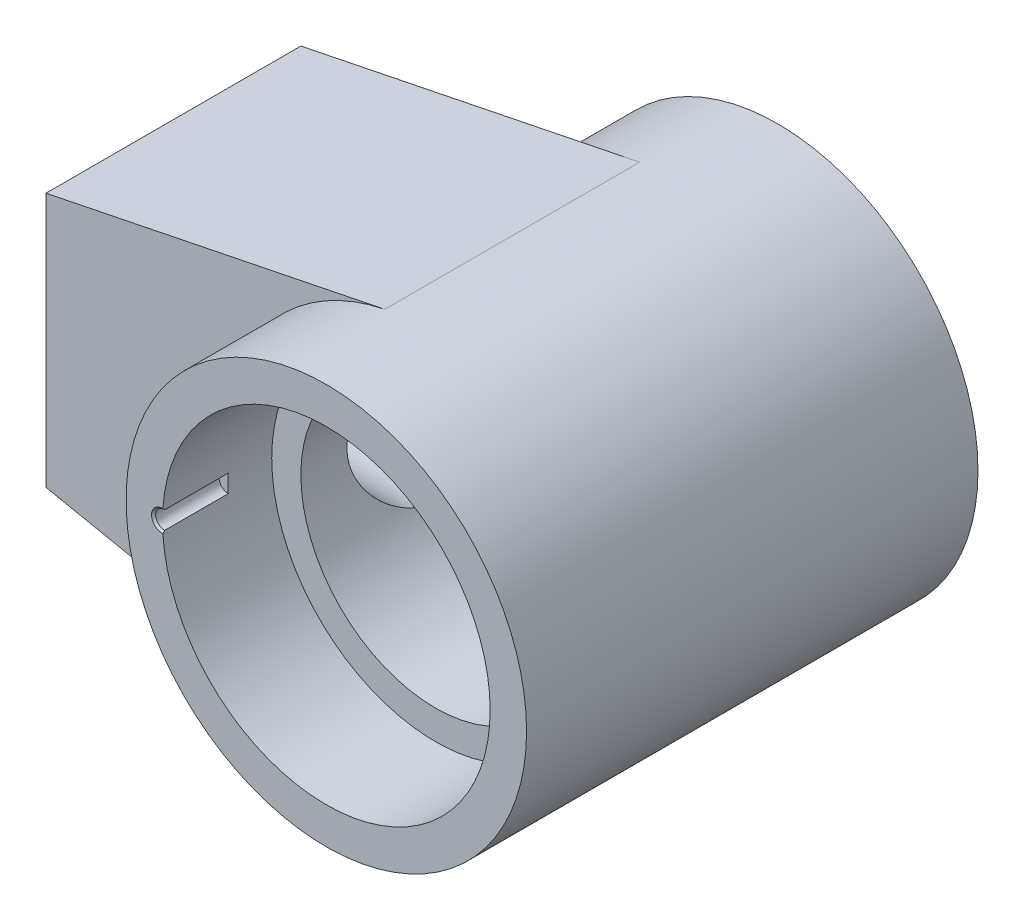
ISO-10303-21;
HEADER;
FILE_DESCRIPTION(('STEP AP214'),'2;1');
FILE_NAME('part.step','',(''),(''),'','','');
FILE_SCHEMA(('AUTOMOTIVE_DESIGN { 1 0 10303 214 1 1 1 1 }'));
ENDSEC;
DATA;
#1=APPLICATION_CONTEXT('core data for automotive mechanical design processes');
#2=APPLICATION_PROTOCOL_DEFINITION('international standard','automotive_design',2000,#1);
#3=PRODUCT_CONTEXT('',#1,'mechanical');
#4=PRODUCT('Part','Part','',(#3));
#5=PRODUCT_RELATED_PRODUCT_CATEGORY('part','',(#4));
#6=PRODUCT_DEFINITION_FORMATION('','',#4);
#7=PRODUCT_DEFINITION_CONTEXT('part definition',#1,'design');
#8=PRODUCT_DEFINITION('design','',#6,#7);
#9=PRODUCT_DEFINITION_SHAPE('','',#8);
#10=(LENGTH_UNIT() NAMED_UNIT(*) SI_UNIT(.MILLI.,.METRE.));
#11=(NAMED_UNIT(*) PLANE_ANGLE_UNIT() SI_UNIT($,.RADIAN.));
#12=(NAMED_UNIT(*) SI_UNIT($,.STERADIAN.) SOLID_ANGLE_UNIT());
#13=UNCERTAINTY_MEASURE_WITH_UNIT(LENGTH_MEASURE(1.E-05),#10,'distance_accuracy_value','');
#14=(GEOMETRIC_REPRESENTATION_CONTEXT(3) GLOBAL_UNCERTAINTY_ASSIGNED_CONTEXT((#13)) GLOBAL_UNIT_ASSIGNED_CONTEXT((#10,
#11,#12)) REPRESENTATION_CONTEXT('',''));
#15=CARTESIAN_POINT('',(0.,0.,0.));
#16=DIRECTION('',(0.,0.,1.));
#17=DIRECTION('',(1.,0.,0.));
#18=AXIS2_PLACEMENT_3D('',#15,#16,#17);
#19=CARTESIAN_POINT('',(0.,0.,62.));
#20=DIRECTION('',(0.,0.,1.));
#21=DIRECTION('',(1.,0.,0.));
#22=AXIS2_PLACEMENT_3D('',#19,#20,#21);
#23=PLANE('',#22);
#24=CARTESIAN_POINT('',(0.,0.,62.));
#25=DIRECTION('',(0.,0.,1.));
#26=DIRECTION('',(1.,0.,0.));
#27=AXIS2_PLACEMENT_3D('',#24,#25,#26);
#28=CIRCLE('',#27,55.);
#29=CARTESIAN_POINT('',(55.,0.,62.));
#30=VERTEX_POINT('',#29);
#31=EDGE_CURVE('E316',#30,#30,#28,.T.);
#32=ORIENTED_EDGE('',*,*,#31,.T.);
#33=EDGE_LOOP('',(#32));
#34=FACE_BOUND('',#33,.T.);
#35=CARTESIAN_POINT('',(0.,0.,62.));
#36=DIRECTION('',(0.,0.,1.));
#37=DIRECTION('',(1.,0.,0.));
#38=AXIS2_PLACEMENT_3D('',#35,#36,#37);
#39=CIRCLE('',#38,45.);
#40=CARTESIAN_POINT('',(-44.9,-2.99833287011296,62.));
#41=VERTEX_POINT('',#40);
#42=CARTESIAN_POINT('',(-44.9,2.99833287011296,62.));
#43=VERTEX_POINT('',#42);
#44=EDGE_CURVE('E287',#41,#43,#39,.T.);
#45=ORIENTED_EDGE('',*,*,#44,.F.);
#46=CARTESIAN_POINT('',(-45.,0.,62.));
#47=DIRECTION('',(0.,0.,1.));
#48=DIRECTION('',(1.,0.,0.));
#49=AXIS2_PLACEMENT_3D('',#46,#47,#48);
#50=CIRCLE('',#49,2.99999999999998);
#51=EDGE_CURVE('E144',#41,#43,#50,.F.);
#52=ORIENTED_EDGE('',*,*,#51,.T.);
#53=EDGE_LOOP('',(#45,#52));
#54=FACE_BOUND('',#53,.T.);
#55=ADVANCED_FACE('F48',(#34,#54),#23,.T.);
#56=CARTESIAN_POINT('',(0.,0.,32.));
#57=DIRECTION('',(0.,0.,1.));
#58=DIRECTION('',(1.,0.,0.));
#59=AXIS2_PLACEMENT_3D('',#56,#57,#58);
#60=CYLINDRICAL_SURFACE('',#59,45.);
#61=CARTESIAN_POINT('',(0.,0.,32.));
#62=DIRECTION('',(0.,0.,1.));
#63=DIRECTION('',(1.,0.,0.));
#64=AXIS2_PLACEMENT_3D('',#61,#62,#63);
#65=CIRCLE('',#64,45.);
#66=CARTESIAN_POINT('',(45.,0.,32.));
#67=VERTEX_POINT('',#66);
#68=EDGE_CURVE('E283',#67,#67,#65,.T.);
#69=ORIENTED_EDGE('',*,*,#68,.F.);
#70=EDGE_LOOP('',(#69));
#71=FACE_BOUND('',#70,.T.);
#72=ORIENTED_EDGE('',*,*,#44,.T.);
#73=CARTESIAN_POINT('',(-44.9,2.99833287011296,62.));
#74=CARTESIAN_POINT('',(-44.9061608501905,2.90607372986825,61.9075876456696));
#75=CARTESIAN_POINT('',(-44.9120371361656,2.81379950729287,61.8151731351687));
#76=CARTESIAN_POINT('',(-44.923220579684,2.62922089749069,61.6303398018353));
#77=CARTESIAN_POINT('',(-44.9285277372275,2.5369165102639,61.537920979003));
#78=CARTESIAN_POINT('',(-44.9335503305556,2.44459704070645,61.4455));
#79=B_SPLINE_CURVE_WITH_KNOTS('',3,(#73,#74,#75,#76,#77,#78),.UNSPECIFIED.,.F.,.F.,(4,2,4),(0.,
0.39218049640312,0.784360992764142),.UNSPECIFIED.);
#80=CARTESIAN_POINT('',(-44.9335503305555,2.44459704070645,61.4455));
#81=VERTEX_POINT('',#80);
#82=EDGE_CURVE('E142',#43,#81,#79,.T.);
#83=ORIENTED_EDGE('',*,*,#82,.T.);
#84=DIRECTION('',(0.,0.,1.));
#85=VECTOR('',#84,1.);
#86=CARTESIAN_POINT('',(-44.9335503305555,2.44459704070645,53.));
#87=LINE('',#86,#85);
#88=CARTESIAN_POINT('',(-44.9335503305556,2.44459704070645,44.));
#89=VERTEX_POINT('',#88);
#90=EDGE_CURVE('E130',#89,#81,#87,.T.);
#91=ORIENTED_EDGE('',*,*,#90,.F.);
#92=CARTESIAN_POINT('',(0.,0.,44.));
#93=DIRECTION('',(0.,0.,1.));
#94=DIRECTION('',(1.,0.,0.));
#95=AXIS2_PLACEMENT_3D('',#92,#93,#94);
#96=CIRCLE('',#95,45.);
#97=CARTESIAN_POINT('',(-44.9335503305556,-2.44459704070645,44.));
#98=VERTEX_POINT('',#97);
#99=EDGE_CURVE('E123',#98,#89,#96,.F.);
#100=ORIENTED_EDGE('',*,*,#99,.F.);
#101=DIRECTION('',(0.,0.,1.));
#102=VECTOR('',#101,1.);
#103=CARTESIAN_POINT('',(-44.9335503305555,-2.44459704070645,53.));
#104=LINE('',#103,#102);
#105=CARTESIAN_POINT('',(-44.9335503305555,-2.44459704070645,61.4455));
#106=VERTEX_POINT('',#105);
#107=EDGE_CURVE('E137',#106,#98,#104,.F.);
#108=ORIENTED_EDGE('',*,*,#107,.F.);
#109=CARTESIAN_POINT('',(-44.9335503305555,-2.44459704070645,61.4455));
#110=CARTESIAN_POINT('',(-44.9285277372275,-2.5369165102639,61.537920979003));
#111=CARTESIAN_POINT('',(-44.923220579684,-2.62922089749069,61.6303398018353));
#112=CARTESIAN_POINT('',(-44.9120371361656,-2.81379950729287,61.8151731351687));
#113=CARTESIAN_POINT('',(-44.9061608501905,-2.90607372986825,61.9075876456696));
#114=CARTESIAN_POINT('',(-44.9,-2.99833287011297,62.));
#115=B_SPLINE_CURVE_WITH_KNOTS('',3,(#109,#110,#111,#112,#113,#114),.UNSPECIFIED.,.F.,.F.,(4,2,
4),(0.,0.392180496361022,0.784360992764143),.UNSPECIFIED.);
#116=EDGE_CURVE('E150',#106,#41,#115,.T.);
#117=ORIENTED_EDGE('',*,*,#116,.T.);
#118=EDGE_LOOP('',(#72,#83,#91,#100,#108,#117));
#119=FACE_BOUND('',#118,.T.);
#120=ADVANCED_FACE('F141',(#71,#119),#60,.F.);
#121=CARTESIAN_POINT('',(0.,0.,-62.));
#122=DIRECTION('',(0.,0.,1.));
#123=DIRECTION('',(1.,0.,0.));
#124=AXIS2_PLACEMENT_3D('',#121,#122,#123);
#125=CYLINDRICAL_SURFACE('',#124,37.);
#126=CARTESIAN_POINT('',(-37.,0.,19.352));
#127=CARTESIAN_POINT('',(-37.0000005981691,-0.506052389142178,19.3520007767979));
#128=CARTESIAN_POINT('',(-36.9895954964608,-1.01209703583665,19.3321292544199));
#129=CARTESIAN_POINT('',(-36.9482420706369,-2.02042269786199,19.2528864913063));
#130=CARTESIAN_POINT('',(-36.9172860887485,-2.52270223963875,19.1935005264803));
#131=CARTESIAN_POINT('',(-36.8355649389102,-3.52022469257321,19.0358422705501));
#132=CARTESIAN_POINT('',(-36.7847708466761,-4.01545622989124,18.9375131968104));
#133=CARTESIAN_POINT('',(-36.6646659427644,-4.9945512790452,18.7031480711273));
#134=CARTESIAN_POINT('',(-36.5953566725505,-5.47841573359016,18.5671151581462));
#135=CARTESIAN_POINT('',(-36.440224593301,-6.42972739055406,18.2594479074291));
#136=CARTESIAN_POINT('',(-36.3544695553745,-6.8972329664037,18.0879594588808));
#137=CARTESIAN_POINT('',(-36.1682555541144,-7.81515442298426,17.7107175181484));
#138=CARTESIAN_POINT('',(-36.0677963363498,-8.26557000783181,17.5049634330466));
#139=CARTESIAN_POINT('',(-35.8544229269288,-9.14690759609061,17.0609914892987));
#140=CARTESIAN_POINT('',(-35.7415107218637,-9.57783269334452,16.8227788072608));
#141=CARTESIAN_POINT('',(-35.5056204451637,-10.4183244494518,16.3156175861637));
#142=CARTESIAN_POINT('',(-35.3826415025798,-10.8278892552367,16.0466663868853));
#143=CARTESIAN_POINT('',(-35.1210067498783,-11.6495728856682,15.461496055963));
#144=CARTESIAN_POINT('',(-34.9818513800329,-12.0601599431576,15.1433489030841));
#145=CARTESIAN_POINT('',(-34.6982309384198,-12.853413226828,14.4761292811505));
#146=CARTESIAN_POINT('',(-34.5537656774987,-13.2360784569017,14.1270557097829));
#147=CARTESIAN_POINT('',(-34.2627491701499,-13.9721424390472,13.3995193011221));
#148=CARTESIAN_POINT('',(-34.1161963924723,-14.325518257621,13.0210338754211));
#149=CARTESIAN_POINT('',(-33.8245859300124,-15.0010924809659,12.2366286963572));
#150=CARTESIAN_POINT('',(-33.679528319043,-15.3232893530283,11.8307075959632));
#151=CARTESIAN_POINT('',(-33.3821014874946,-15.9615099909244,10.9566349452515));
#152=CARTESIAN_POINT('',(-33.2301954305391,-16.2745533634966,10.4861423888152));
#153=CARTESIAN_POINT('',(-32.9372410994983,-16.8595731989986,9.51708917371545));
#154=CARTESIAN_POINT('',(-32.7961920865564,-17.131552457686,9.01853042905083));
#155=CARTESIAN_POINT('',(-32.5299271173334,-17.6319075215883,7.99621219001476));
#156=CARTESIAN_POINT('',(-32.4047032093171,-17.8603052551288,7.47246553608207));
#157=CARTESIAN_POINT('',(-32.1748937237233,-18.2710614497447,6.40283467926718));
#158=CARTESIAN_POINT('',(-32.070305650227,-18.4534254793753,5.85695316325201));
#159=CARTESIAN_POINT('',(-31.8919827061672,-18.7598220436959,4.7814252518492));
#160=CARTESIAN_POINT('',(-31.8167412212346,-18.8867616418427,4.25285847438943));
#161=CARTESIAN_POINT('',(-31.6915810918886,-19.0960370571894,3.18398352995439));
#162=CARTESIAN_POINT('',(-31.6416612640038,-19.1783749589742,2.64367591294793));
#163=CARTESIAN_POINT('',(-31.5694436736182,-19.2970225373591,1.55672928224647));
#164=CARTESIAN_POINT('',(-31.5471182663029,-19.3333782809433,1.01009715983012));
#165=CARTESIAN_POINT('',(-31.5310617463493,-19.3595565594709,-0.0846732269199204));
#166=CARTESIAN_POINT('',(-31.5373274167103,-19.3493843296321,-0.632811314870108));
#167=CARTESIAN_POINT('',(-31.5753870002611,-19.2871961525082,-1.65183489643683));
#168=CARTESIAN_POINT('',(-31.6036443295844,-19.2409753102658,-2.12322143275913));
#169=CARTESIAN_POINT('',(-31.6803413348338,-19.1144305464454,-3.05967906561738));
#170=CARTESIAN_POINT('',(-31.728778874972,-19.0341102337937,-3.52475082510554));
#171=CARTESIAN_POINT('',(-31.8442374179493,-18.8403085656461,-4.44569562723011));
#172=CARTESIAN_POINT('',(-31.9112640219202,-18.7268172147198,-4.9015658528383));
#173=CARTESIAN_POINT('',(-32.0617991540604,-18.4679026779113,-5.80135095111683));
#174=CARTESIAN_POINT('',(-32.1453086291952,-18.3224776573382,-6.24526513522869));
#175=CARTESIAN_POINT('',(-32.3284407218987,-17.9974295654423,-7.12874197277612));
#176=CARTESIAN_POINT('',(-32.4283840409931,-17.8171096913214,-7.56798113288297));
#177=CARTESIAN_POINT('',(-32.6402718684333,-17.4259040580488,-8.4298186509097));
#178=CARTESIAN_POINT('',(-32.7522213163215,-17.2150057056921,-8.85241006111709));
#179=CARTESIAN_POINT('',(-32.9852876082079,-16.7641043545781,-9.67917636643004));
#180=CARTESIAN_POINT('',(-33.106405531151,-16.5240979283788,-10.0833490850325));
#181=CARTESIAN_POINT('',(-33.3550116728951,-16.0163388116769,-10.8718314861868));
#182=CARTESIAN_POINT('',(-33.4825004458614,-15.7485837052851,-11.2561394348751));
#183=CARTESIAN_POINT('',(-33.7593067870855,-15.1470671266721,-12.0561468439793));
#184=CARTESIAN_POINT('',(-33.9091736677915,-14.8093179555884,-12.4686651527801));
#185=CARTESIAN_POINT('',(-34.2097412192137,-14.1011202046737,-13.2643133259577));
#186=CARTESIAN_POINT('',(-34.3604419556169,-13.7306690133557,-13.6474408386977));
#187=CARTESIAN_POINT('',(-34.659003455252,-12.9585826659496,-14.3826048420035));
#188=CARTESIAN_POINT('',(-34.80686253717,-12.5569297168324,-14.7346233442141));
#189=CARTESIAN_POINT('',(-35.0960263974538,-11.7244647776846,-15.405275418106));
#190=CARTESIAN_POINT('',(-35.2373314477179,-11.2936539991125,-15.7239103754172));
#191=CARTESIAN_POINT('',(-35.5174897446434,-10.3801997012022,-16.3423423145476));
#192=CARTESIAN_POINT('',(-35.6557728414984,-9.89600673272484,-16.6401158411191));
#193=CARTESIAN_POINT('',(-35.917311260513,-8.90010010147755,-17.1933880252406));
#194=CARTESIAN_POINT('',(-36.0405657689675,-8.38838495071148,-17.4488843940111));
#195=CARTESIAN_POINT('',(-36.2683629257818,-7.34116784706474,-17.9146672515024));
#196=CARTESIAN_POINT('',(-36.3729184458063,-6.80568257601899,-18.124984859758));
#197=CARTESIAN_POINT('',(-36.5602063333196,-5.71467324933082,-18.4979629467246));
#198=CARTESIAN_POINT('',(-36.6429414786077,-5.15915175460505,-18.6606294918511));
#199=CARTESIAN_POINT('',(-36.7777517321049,-4.08229149323092,-18.9239141749623));
#200=CARTESIAN_POINT('',(-36.8318806636757,-3.56223259032856,-19.028725495518));
#201=CARTESIAN_POINT('',(-36.9182766530851,-2.51348101085802,-19.1954202796859));
#202=CARTESIAN_POINT('',(-36.9505449626162,-1.98478883038832,-19.2573062011193));
#203=CARTESIAN_POINT('',(-36.9922853940242,-0.923447573826113,-19.3372760233808));
#204=CARTESIAN_POINT('',(-37.0017679265282,-0.390800416355899,-19.3553799278633));
#205=CARTESIAN_POINT('',(-36.9976898987752,0.674069841192297,-19.3475834527039));
#206=CARTESIAN_POINT('',(-36.984130556373,1.20629296219482,-19.3216853987406));
#207=CARTESIAN_POINT('',(-36.9365301316964,2.2197850358863,-19.2304055188542));
#208=CARTESIAN_POINT('',(-36.9043653413018,2.70147358304109,-19.1686389143131));
#209=CARTESIAN_POINT('',(-36.8219251070411,3.65730748968205,-19.0094375075377));
#210=CARTESIAN_POINT('',(-36.7716509640792,4.13145338844824,-18.9120052673735));
#211=CARTESIAN_POINT('',(-36.6541544995467,5.06914942263336,-18.6825225783252));
#212=CARTESIAN_POINT('',(-36.5869312926692,5.53269900319093,-18.5504703211063));
#213=CARTESIAN_POINT('',(-36.4370423793131,6.4464190426839,-18.253066830169));
#214=CARTESIAN_POINT('',(-36.3543760091159,6.89658892562041,-18.0877141652368));
#215=CARTESIAN_POINT('',(-36.1730352117827,7.79268476694923,-17.7204554527878));
#216=CARTESIAN_POINT('',(-36.0739984072793,8.23819120654106,-17.5177058997264));
#217=CARTESIAN_POINT('',(-35.8636869060655,9.1102793819269,-17.0804180991494));
#218=CARTESIAN_POINT('',(-35.7524121301092,9.53686099514975,-16.8458796457853));
#219=CARTESIAN_POINT('',(-35.5199137876705,10.3693078564812,-16.3466505031095));
#220=CARTESIAN_POINT('',(-35.398687395072,10.7751671663087,-16.081951240223));
#221=CARTESIAN_POINT('',(-35.1487632701505,11.5644211165479,-15.5240989932343));
#222=CARTESIAN_POINT('',(-35.0200649125689,11.9478138715348,-15.2309436265247));
#223=CARTESIAN_POINT('',(-34.7439942563599,12.7296606551594,-14.585568835572));
#224=CARTESIAN_POINT('',(-34.5960792549236,13.1254757882933,-14.2303794749891));
#225=CARTESIAN_POINT('',(-34.2978526144724,13.8861171225775,-13.4891707455103));
#226=CARTESIAN_POINT('',(-34.1475408224038,14.2509413352277,-13.1031494013908));
#227=CARTESIAN_POINT('',(-33.8481184643427,14.9482079366972,-12.3017575627707));
#228=CARTESIAN_POINT('',(-33.6990089827763,15.2806235646793,-11.8863632942375));
#229=CARTESIAN_POINT('',(-33.4793218872077,15.7532607399888,-11.2430206281004));
#230=CARTESIAN_POINT('',(-33.406753318712,15.9064801711803,-11.0251901394122));
#231=CARTESIAN_POINT('',(-33.2634066232808,16.2041064523991,-10.5829065536732));
#232=CARTESIAN_POINT('',(-33.1926290942553,16.3485103816549,-10.3584512978386));
#233=CARTESIAN_POINT('',(-32.9752508244734,16.7851943253054,-9.64772459253451));
#234=CARTESIAN_POINT('',(-32.8326898383814,17.0615765575446,-9.15029550971333));
#235=CARTESIAN_POINT('',(-32.5630013305178,17.5708298932735,-8.12963618723386));
#236=CARTESIAN_POINT('',(-32.4358720382279,17.8037059899915,-7.60640891717358));
#237=CARTESIAN_POINT('',(-32.260509095359,18.1183312996264,-6.80501993029528));
#238=CARTESIAN_POINT('',(-32.2046255451745,18.2173984917431,-6.53522218657912));
#239=CARTESIAN_POINT('',(-32.0985284318642,18.4036936358615,-5.99056031879956));
#240=CARTESIAN_POINT('',(-32.0483134167665,18.4909246208208,-5.71569751321001));
#241=CARTESIAN_POINT('',(-31.9070160492189,18.7344011095114,-4.88419822459491));
#242=CARTESIAN_POINT('',(-31.8252418369042,18.8725001436232,-4.32047302530095));
#243=CARTESIAN_POINT('',(-31.6971168666236,19.0868217547136,-3.23549776274078));
#244=CARTESIAN_POINT('',(-31.6480834377358,19.1677756975774,-2.71548701861714));
#245=CARTESIAN_POINT('',(-31.5755072700609,19.2871014711559,-1.66880744655593));
#246=CARTESIAN_POINT('',(-31.5519627220079,19.325476324248,-1.14213909387759));
#247=CARTESIAN_POINT('',(-31.5314076629037,19.3589957657291,-0.0871839512284485));
#248=CARTESIAN_POINT('',(-31.534383790771,19.354162122498,0.44110188976167));
#249=CARTESIAN_POINT('',(-31.5667068975352,19.3013983330508,1.49468267284914));
#250=CARTESIAN_POINT('',(-31.5960523695072,19.2534706495234,2.01997778413105));
#251=CARTESIAN_POINT('',(-31.6750731646601,19.1231470657912,3.00380044512967));
#252=CARTESIAN_POINT('',(-31.7220703132057,19.0452684611862,3.46315328640321));
#253=CARTESIAN_POINT('',(-31.8342334669313,18.8571885807057,4.37287671559751));
#254=CARTESIAN_POINT('',(-31.899397757537,18.7469903550327,4.82324814686769));
#255=CARTESIAN_POINT('',(-32.0459245414392,18.4954015672806,5.71258878904172));
#256=CARTESIAN_POINT('',(-32.1272912655395,18.3540028570393,6.15155498787794));
#257=CARTESIAN_POINT('',(-32.3039158117941,18.041320394145,7.01583129211518));
#258=CARTESIAN_POINT('',(-32.3991746048758,17.8700345524932,7.44114044047729));
#259=CARTESIAN_POINT('',(-32.6077299321633,17.4867547698549,8.30363521170009));
#260=CARTESIAN_POINT('',(-32.7217990905151,17.2728298458648,8.73977535231031));
#261=CARTESIAN_POINT('',(-32.9598973638925,16.81404080648,9.59284216950277));
#262=CARTESIAN_POINT('',(-33.0839307490239,16.5691634005424,10.0097604869367));
#263=CARTESIAN_POINT('',(-33.3389064434658,16.0499521501269,10.8227361641136));
#264=CARTESIAN_POINT('',(-33.469850299147,15.7756116983036,11.2187888147414));
#265=CARTESIAN_POINT('',(-33.7356590189858,15.1988861554762,11.9885397413551));
#266=CARTESIAN_POINT('',(-33.8705241594467,14.896499084935,12.3622364363854));
#267=CARTESIAN_POINT('',(-34.1599169908618,14.221558765677,13.1356590096056));
#268=CARTESIAN_POINT('',(-34.3145999667534,13.8450735724197,13.5319052090578));
#269=CARTESIAN_POINT('',(-34.6212562198267,13.0593448718685,14.2916798255785));
#270=CARTESIAN_POINT('',(-34.7732292482839,12.6500983764059,14.6552052517362));
#271=CARTESIAN_POINT('',(-35.0706475138065,11.8005228607647,15.3475735729091));
#272=CARTESIAN_POINT('',(-35.2160884552942,11.3601738629816,15.6763938318249));
#273=CARTESIAN_POINT('',(-35.4965755212362,10.4508131239708,16.2967271083901));
#274=CARTESIAN_POINT('',(-35.6316221240308,9.98180270350597,16.5882418432234));
#275=CARTESIAN_POINT('',(-35.8901308113983,9.00869333750198,17.1365380549132));
#276=CARTESIAN_POINT('',(-36.0133325198498,8.50410594122311,17.3925776270413));
#277=CARTESIAN_POINT('',(-36.2417613040972,7.47091883123979,17.8607654699294));
#278=CARTESIAN_POINT('',(-36.3469858824916,6.94231579414935,18.0729076432805));
#279=CARTESIAN_POINT('',(-36.5360623635611,5.86632504968395,18.4502129480697));
#280=CARTESIAN_POINT('',(-36.6199650397401,5.31898555731215,18.6154877948689));
#281=CARTESIAN_POINT('',(-36.7640580734905,4.2091387063873,18.8973695241368));
#282=CARTESIAN_POINT('',(-36.8242620069507,3.64664022961645,19.0140042724997));
#283=CARTESIAN_POINT('',(-36.9140578865085,2.57137901876232,19.1872982946929));
#284=CARTESIAN_POINT('',(-36.9462107262062,2.05963536059365,19.2489895990092));
#285=CARTESIAN_POINT('',(-36.9891817015716,1.03192517761904,19.3313404856177));
#286=CARTESIAN_POINT('',(-36.9999993901215,0.515958564540758,19.351999207996));
#287=CARTESIAN_POINT('',(-37.,0.,19.352));
#288=B_SPLINE_CURVE_WITH_KNOTS('',3,(#126,#127,#128,#129,#130,#131,#132,#133,#134,#135,#136,
#137,#138,#139,#140,#141,#142,#143,#144,#145,#146,#147,#148,#149,#150,#151,#152,#153,#154,#155,
#156,#157,#158,#159,#160,#161,#162,#163,#164,#165,#166,#167,#168,#169,#170,#171,#172,#173,#174,
#175,#176,#177,#178,#179,#180,#181,#182,#183,#184,#185,#186,#187,#188,#189,#190,#191,#192,#193,
#194,#195,#196,#197,#198,#199,#200,#201,#202,#203,#204,#205,#206,#207,#208,#209,#210,#211,#212,
#213,#214,#215,#216,#217,#218,#219,#220,#221,#222,#223,#224,#225,#226,#227,#228,#229,#230,#231,
#232,#233,#234,#235,#236,#237,#238,#239,#240,#241,#242,#243,#244,#245,#246,#247,#248,#249,#250,
#251,#252,#253,#254,#255,#256,#257,#258,#259,#260,#261,#262,#263,#264,#265,#266,#267,#268,#269,
#270,#271,#272,#273,#274,#275,#276,#277,#278,#279,#280,#281,#282,#283,#284,#285,#286,#287),
.UNSPECIFIED.,.T.,.F.,(4,2,2,2,2,2,2,2,2,2,2,2,2,2,2,2,2,2,2,2,2,2,2,2,2,2,2,2,2,2,2,2,2,2,2,2,
2,2,2,2,2,2,2,2,2,2,2,2,2,2,2,2,2,2,2,2,2,2,2,2,2,2,2,2,2,2,2,2,2,2,2,2,2,2,2,2,2,2,2,2,4),(0.,
1.51765057658801,3.03586698547042,4.55630529197482,6.07661705524856,7.59079342198909,
9.10499599210131,10.6189573540407,12.1330498388746,13.7445784661489,15.3561645564023,
16.9690008207652,18.5819163294347,20.3352753018366,22.0885148468636,23.8408698984163,
25.5930128712905,27.2369385512288,28.8807873910761,30.5229880416858,32.1650039203017,
33.5867909415078,35.0084275250164,36.4304929327743,37.8526400641089,39.3068352997644,
40.7616311300762,42.2165984275301,43.6716925056941,45.331328403169,46.9910969543783,
48.6518190484942,50.312472184728,52.0651834544694,53.8179895805842,55.5695844589579,
57.3209562462944,58.9185940540217,60.5161403766929,62.1129566551776,63.7096885381941,
65.1680816077877,66.6263699330773,68.0847344454755,69.5431616501118,71.0397636536801,
72.5363753489344,74.0334135405364,75.530577186286,77.1847925060837,78.8391138868381,
80.4947899267345,81.3226840434418,82.1508509875671,83.9083479373865,85.6656430540208,
86.5437228079764,87.4215771325891,89.1767027371958,90.7601396233252,92.3434641056842,
93.9259909563618,95.5084273763561,96.9116853229361,98.3148108779753,99.7183033008643,
101.121893861963,102.617378251347,104.113506975213,105.609971922405,107.106542570948,
108.80876463641,110.511142139372,112.214623227195,113.918025875065,115.652925324961,
117.38806559325,119.119034442384,120.849010253252,122.396337012554,123.943696198622),.UNSPECIFIED.);
#289=CARTESIAN_POINT('',(-37.,0.,19.352));
#290=VERTEX_POINT('',#289);
#291=EDGE_CURVE('E248',#290,#290,#288,.T.);
#292=ORIENTED_EDGE('',*,*,#291,.F.);
#293=EDGE_LOOP('',(#292));
#294=FACE_BOUND('',#293,.T.);
#295=CARTESIAN_POINT('',(0.,0.,32.));
#296=DIRECTION('',(0.,0.,1.));
#297=DIRECTION('',(1.,0.,0.));
#298=AXIS2_PLACEMENT_3D('',#295,#296,#297);
#299=CIRCLE('',#298,37.);
#300=CARTESIAN_POINT('',(37.,0.,32.));
#301=VERTEX_POINT('',#300);
#302=EDGE_CURVE('E286',#301,#301,#299,.F.);
#303=ORIENTED_EDGE('',*,*,#302,.F.);
#304=EDGE_LOOP('',(#303));
#305=FACE_BOUND('',#304,.T.);
#306=CARTESIAN_POINT('',(0.,0.,-32.));
#307=DIRECTION('',(0.,0.,-1.));
#308=DIRECTION('',(-1.,0.,0.));
#309=AXIS2_PLACEMENT_3D('',#306,#307,#308);
#310=CIRCLE('',#309,37.);
#311=CARTESIAN_POINT('',(-37.,0.,-32.));
#312=VERTEX_POINT('',#311);
#313=EDGE_CURVE('E234',#312,#312,#310,.F.);
#314=ORIENTED_EDGE('',*,*,#313,.F.);
#315=EDGE_LOOP('',(#314));
#316=FACE_BOUND('',#315,.T.);
#317=ADVANCED_FACE('F167',(#294,#305,#316),#125,.F.);
#318=CARTESIAN_POINT('',(0.,0.,-62.));
#319=DIRECTION('',(0.,0.,1.));
#320=DIRECTION('',(1.,0.,0.));
#321=AXIS2_PLACEMENT_3D('',#318,#319,#320);
#322=PLANE('',#321);
#323=CARTESIAN_POINT('',(0.,0.,-62.));
#324=DIRECTION('',(0.,0.,1.));
#325=DIRECTION('',(1.,0.,0.));
#326=AXIS2_PLACEMENT_3D('',#323,#324,#325);
#327=CIRCLE('',#326,55.);
#328=CARTESIAN_POINT('',(55.,0.,-62.));
#329=VERTEX_POINT('',#328);
#330=EDGE_CURVE('E315',#329,#329,#327,.T.);
#331=ORIENTED_EDGE('',*,*,#330,.F.);
#332=EDGE_LOOP('',(#331));
#333=FACE_BOUND('',#332,.T.);
#334=CARTESIAN_POINT('',(0.,0.,-62.));
#335=DIRECTION('',(0.,0.,1.));
#336=DIRECTION('',(1.,0.,0.));
#337=AXIS2_PLACEMENT_3D('',#334,#335,#336);
#338=CIRCLE('',#337,45.);
#339=CARTESIAN_POINT('',(-44.9,-2.99833287011296,-62.));
#340=VERTEX_POINT('',#339);
#341=CARTESIAN_POINT('',(-44.9,2.99833287011291,-62.));
#342=VERTEX_POINT('',#341);
#343=EDGE_CURVE('E278',#340,#342,#338,.T.);
#344=ORIENTED_EDGE('',*,*,#343,.T.);
#345=CARTESIAN_POINT('',(-45.,0.,-62.));
#346=DIRECTION('',(0.,0.,1.));
#347=DIRECTION('',(1.,0.,0.));
#348=AXIS2_PLACEMENT_3D('',#345,#346,#347);
#349=CIRCLE('',#348,2.99999999999998);
#350=EDGE_CURVE('E13',#342,#340,#349,.T.);
#351=ORIENTED_EDGE('',*,*,#350,.T.);
#352=EDGE_LOOP('',(#344,#351));
#353=FACE_BOUND('',#352,.T.);
#354=ADVANCED_FACE('F174',(#333,#353),#322,.F.);
#355=CARTESIAN_POINT('',(0.,0.,62.));
#356=DIRECTION('',(0.,0.,-1.));
#357=DIRECTION('',(-1.,0.,0.));
#358=AXIS2_PLACEMENT_3D('',#355,#356,#357);
#359=CYLINDRICAL_SURFACE('',#358,55.);
#360=CARTESIAN_POINT('',(0.,0.,35.));
#361=DIRECTION('',(0.,0.,1.));
#362=DIRECTION('',(1.,0.,0.));
#363=AXIS2_PLACEMENT_3D('',#360,#361,#362);
#364=CIRCLE('',#363,55.);
#365=CARTESIAN_POINT('',(-10.9472807038264,53.8995087657729,35.));
#366=VERTEX_POINT('',#365);
#367=CARTESIAN_POINT('',(-10.9472807038264,-53.8995087657729,35.));
#368=VERTEX_POINT('',#367);
#369=EDGE_CURVE('E227',#366,#368,#364,.T.);
#370=ORIENTED_EDGE('',*,*,#369,.T.);
#371=DIRECTION('',(0.,0.,-1.));
#372=VECTOR('',#371,1.);
#373=CARTESIAN_POINT('',(-10.9472807038264,-53.8995087657729,35.));
#374=LINE('',#373,#372);
#375=CARTESIAN_POINT('',(-10.9472807038264,-53.8995087657729,-35.));
#376=VERTEX_POINT('',#375);
#377=EDGE_CURVE('E292',#368,#376,#374,.T.);
#378=ORIENTED_EDGE('',*,*,#377,.T.);
#379=CARTESIAN_POINT('',(0.,0.,-35.));
#380=DIRECTION('',(0.,0.,1.));
#381=DIRECTION('',(1.,0.,0.));
#382=AXIS2_PLACEMENT_3D('',#379,#380,#381);
#383=CIRCLE('',#382,55.);
#384=CARTESIAN_POINT('',(-10.9472807038264,53.8995087657729,-35.));
#385=VERTEX_POINT('',#384);
#386=EDGE_CURVE('E231',#385,#376,#383,.T.);
#387=ORIENTED_EDGE('',*,*,#386,.F.);
#388=DIRECTION('',(0.,0.,-1.));
#389=VECTOR('',#388,1.);
#390=CARTESIAN_POINT('',(-10.9472807038264,53.8995087657729,35.));
#391=LINE('',#390,#389);
#392=EDGE_CURVE('E312',#366,#385,#391,.T.);
#393=ORIENTED_EDGE('',*,*,#392,.F.);
#394=EDGE_LOOP('',(#370,#378,#387,#393));
#395=FACE_BOUND('',#394,.T.);
#396=ORIENTED_EDGE('',*,*,#31,.F.);
#397=EDGE_LOOP('',(#396));
#398=FACE_BOUND('',#397,.T.);
#399=ORIENTED_EDGE('',*,*,#330,.T.);
#400=EDGE_LOOP('',(#399));
#401=FACE_BOUND('',#400,.T.);
#402=ADVANCED_FACE('F185',(#395,#398,#401),#359,.T.);
#403=CARTESIAN_POINT('',(0.,0.,35.));
#404=DIRECTION('',(0.,0.,1.));
#405=DIRECTION('',(1.,0.,0.));
#406=AXIS2_PLACEMENT_3D('',#403,#404,#405);
#407=PLANE('',#406);
#408=ORIENTED_EDGE('',*,*,#369,.F.);
#409=DIRECTION('',(-0.979991068468598,-0.199041467342299,0.));
#410=VECTOR('',#409,1.);
#411=CARTESIAN_POINT('',(-104.,35.,35.));
#412=LINE('',#411,#410);
#413=CARTESIAN_POINT('',(-104.,35.,35.));
#414=VERTEX_POINT('',#413);
#415=EDGE_CURVE('E302',#366,#414,#412,.T.);
#416=ORIENTED_EDGE('',*,*,#415,.T.);
#417=DIRECTION('',(0.,-1.,0.));
#418=VECTOR('',#417,1.);
#419=CARTESIAN_POINT('',(-104.,0.,35.));
#420=LINE('',#419,#418);
#421=CARTESIAN_POINT('',(-104.,-35.,35.));
#422=VERTEX_POINT('',#421);
#423=EDGE_CURVE('E304',#414,#422,#420,.T.);
#424=ORIENTED_EDGE('',*,*,#423,.T.);
#425=DIRECTION('',(-0.979991068468598,0.199041467342298,0.));
#426=VECTOR('',#425,1.);
#427=CARTESIAN_POINT('',(-104.,-35.,35.));
#428=LINE('',#427,#426);
#429=EDGE_CURVE('E289',#368,#422,#428,.T.);
#430=ORIENTED_EDGE('',*,*,#429,.F.);
#431=EDGE_LOOP('',(#408,#416,#424,#430));
#432=FACE_BOUND('',#431,.T.);
#433=ADVANCED_FACE('F181',(#432),#407,.T.);
#434=CARTESIAN_POINT('',(0.,0.,-35.));
#435=DIRECTION('',(0.,0.,1.));
#436=DIRECTION('',(1.,0.,0.));
#437=AXIS2_PLACEMENT_3D('',#434,#435,#436);
#438=PLANE('',#437);
#439=DIRECTION('',(-0.979991068468598,-0.199041467342299,0.));
#440=VECTOR('',#439,1.);
#441=CARTESIAN_POINT('',(-104.,35.,-35.));
#442=LINE('',#441,#440);
#443=CARTESIAN_POINT('',(-104.,35.,-35.));
#444=VERTEX_POINT('',#443);
#445=EDGE_CURVE('E301',#385,#444,#442,.T.);
#446=ORIENTED_EDGE('',*,*,#445,.F.);
#447=ORIENTED_EDGE('',*,*,#386,.T.);
#448=DIRECTION('',(-0.979991068468598,0.199041467342298,0.));
#449=VECTOR('',#448,1.);
#450=CARTESIAN_POINT('',(-104.,-35.,-35.));
#451=LINE('',#450,#449);
#452=CARTESIAN_POINT('',(-104.,-35.,-35.));
#453=VERTEX_POINT('',#452);
#454=EDGE_CURVE('E293',#376,#453,#451,.T.);
#455=ORIENTED_EDGE('',*,*,#454,.T.);
#456=DIRECTION('',(0.,-1.,0.));
#457=VECTOR('',#456,1.);
#458=CARTESIAN_POINT('',(-104.,0.,-35.));
#459=LINE('',#458,#457);
#460=EDGE_CURVE('E305',#444,#453,#459,.T.);
#461=ORIENTED_EDGE('',*,*,#460,.F.);
#462=EDGE_LOOP('',(#446,#447,#455,#461));
#463=FACE_BOUND('',#462,.T.);
#464=ADVANCED_FACE('F184',(#463),#438,.F.);
#465=CARTESIAN_POINT('',(-104.,35.,35.));
#466=DIRECTION('',(0.199041467342299,-0.979991068468598,0.));
#467=DIRECTION('',(0.979991068468598,0.199041467342299,0.));
#468=AXIS2_PLACEMENT_3D('',#465,#466,#467);
#469=PLANE('',#468);
#470=ORIENTED_EDGE('',*,*,#445,.T.);
#471=DIRECTION('',(0.,0.,-1.));
#472=VECTOR('',#471,1.);
#473=CARTESIAN_POINT('',(-104.,35.,35.));
#474=LINE('',#473,#472);
#475=EDGE_CURVE('E307',#414,#444,#474,.T.);
#476=ORIENTED_EDGE('',*,*,#475,.F.);
#477=ORIENTED_EDGE('',*,*,#415,.F.);
#478=ORIENTED_EDGE('',*,*,#392,.T.);
#479=EDGE_LOOP('',(#470,#476,#477,#478));
#480=FACE_BOUND('',#479,.T.);
#481=ADVANCED_FACE('F189',(#480),#469,.F.);
#482=CARTESIAN_POINT('',(-104.,0.,35.));
#483=DIRECTION('',(1.,0.,0.));
#484=DIRECTION('',(0.,0.,-1.));
#485=AXIS2_PLACEMENT_3D('',#482,#483,#484);
#486=PLANE('',#485);
#487=CARTESIAN_POINT('',(-104.,0.,0.));
#488=DIRECTION('',(1.,0.,0.));
#489=DIRECTION('',(0.,0.,-1.));
#490=AXIS2_PLACEMENT_3D('',#487,#488,#489);
#491=CIRCLE('',#490,20.9999999999999);
#492=CARTESIAN_POINT('',(-104.,0.,-20.9999999999999));
#493=VERTEX_POINT('',#492);
#494=EDGE_CURVE('E223',#493,#493,#491,.T.);
#495=ORIENTED_EDGE('',*,*,#494,.T.);
#496=EDGE_LOOP('',(#495));
#497=FACE_BOUND('',#496,.T.);
#498=ORIENTED_EDGE('',*,*,#460,.T.);
#499=DIRECTION('',(0.,0.,-1.));
#500=VECTOR('',#499,1.);
#501=CARTESIAN_POINT('',(-104.,-35.,35.));
#502=LINE('',#501,#500);
#503=EDGE_CURVE('E298',#422,#453,#502,.T.);
#504=ORIENTED_EDGE('',*,*,#503,.F.);
#505=ORIENTED_EDGE('',*,*,#423,.F.);
#506=ORIENTED_EDGE('',*,*,#475,.T.);
#507=EDGE_LOOP('',(#498,#504,#505,#506));
#508=FACE_BOUND('',#507,.T.);
#509=ADVANCED_FACE('F179',(#497,#508),#486,.F.);
#510=CARTESIAN_POINT('',(-104.,-35.,35.));
#511=DIRECTION('',(-0.199041467342298,-0.979991068468598,0.));
#512=DIRECTION('',(0.979991068468598,-0.199041467342298,0.));
#513=AXIS2_PLACEMENT_3D('',#510,#511,#512);
#514=PLANE('',#513);
#515=ORIENTED_EDGE('',*,*,#454,.F.);
#516=ORIENTED_EDGE('',*,*,#377,.F.);
#517=ORIENTED_EDGE('',*,*,#429,.T.);
#518=ORIENTED_EDGE('',*,*,#503,.T.);
#519=EDGE_LOOP('',(#515,#516,#517,#518));
#520=FACE_BOUND('',#519,.T.);
#521=ADVANCED_FACE('F176',(#520),#514,.T.);
#522=CARTESIAN_POINT('',(0.,0.,32.));
#523=DIRECTION('',(0.,0.,1.));
#524=DIRECTION('',(1.,0.,0.));
#525=AXIS2_PLACEMENT_3D('',#522,#523,#524);
#526=PLANE('',#525);
#527=ORIENTED_EDGE('',*,*,#68,.T.);
#528=EDGE_LOOP('',(#527));
#529=FACE_BOUND('',#528,.T.);
#530=ORIENTED_EDGE('',*,*,#302,.T.);
#531=EDGE_LOOP('',(#530));
#532=FACE_BOUND('',#531,.T.);
#533=ADVANCED_FACE('F169',(#529,#532),#526,.T.);
#534=CARTESIAN_POINT('',(0.,0.,-32.));
#535=DIRECTION('',(0.,0.,-1.));
#536=DIRECTION('',(1.,0.,0.));
#537=AXIS2_PLACEMENT_3D('',#534,#535,#536);
#538=PLANE('',#537);
#539=CARTESIAN_POINT('',(0.,0.,-32.));
#540=DIRECTION('',(0.,0.,1.));
#541=DIRECTION('',(1.,0.,0.));
#542=AXIS2_PLACEMENT_3D('',#539,#540,#541);
#543=CIRCLE('',#542,45.);
#544=CARTESIAN_POINT('',(45.,0.,-32.));
#545=VERTEX_POINT('',#544);
#546=EDGE_CURVE('E279',#545,#545,#543,.T.);
#547=ORIENTED_EDGE('',*,*,#546,.F.);
#548=EDGE_LOOP('',(#547));
#549=FACE_BOUND('',#548,.T.);
#550=ORIENTED_EDGE('',*,*,#313,.T.);
#551=EDGE_LOOP('',(#550));
#552=FACE_BOUND('',#551,.T.);
#553=ADVANCED_FACE('F266',(#549,#552),#538,.T.);
#554=CARTESIAN_POINT('',(0.,0.,-32.));
#555=DIRECTION('',(0.,0.,-1.));
#556=DIRECTION('',(-1.,0.,0.));
#557=AXIS2_PLACEMENT_3D('',#554,#555,#556);
#558=CYLINDRICAL_SURFACE('',#557,45.);
#559=DIRECTION('',(0.,0.,-1.));
#560=VECTOR('',#559,1.);
#561=CARTESIAN_POINT('',(-44.9335503305555,2.44459704070645,-53.));
#562=LINE('',#561,#560);
#563=CARTESIAN_POINT('',(-44.9335503305555,2.44459704070645,-61.4455));
#564=VERTEX_POINT('',#563);
#565=CARTESIAN_POINT('',(-44.9335503305556,2.44459704070645,-44.));
#566=VERTEX_POINT('',#565);
#567=EDGE_CURVE('E131',#564,#566,#562,.F.);
#568=ORIENTED_EDGE('',*,*,#567,.F.);
#569=CARTESIAN_POINT('',(-44.9335503305555,2.44459704070645,-61.4455));
#570=CARTESIAN_POINT('',(-44.9285277372275,2.5369165102639,-61.537920979003));
#571=CARTESIAN_POINT('',(-44.923220579684,2.62922089749069,-61.6303398018353));
#572=CARTESIAN_POINT('',(-44.9120371361656,2.81379950729287,-61.8151731351687));
#573=CARTESIAN_POINT('',(-44.9061608501905,2.90607372986825,-61.9075876456696));
#574=CARTESIAN_POINT('',(-44.9,2.99833287011297,-62.));
#575=B_SPLINE_CURVE_WITH_KNOTS('',3,(#569,#570,#571,#572,#573,#574),.UNSPECIFIED.,.F.,.F.,(4,2,
4),(0.,0.392180496361036,0.784360992764153),.UNSPECIFIED.);
#576=EDGE_CURVE('E57',#564,#342,#575,.T.);
#577=ORIENTED_EDGE('',*,*,#576,.T.);
#578=ORIENTED_EDGE('',*,*,#343,.F.);
#579=CARTESIAN_POINT('',(-44.9,-2.99833287011296,-62.));
#580=CARTESIAN_POINT('',(-44.9061608501905,-2.90607372986825,-61.9075876456696));
#581=CARTESIAN_POINT('',(-44.9120371361656,-2.81379950729287,-61.8151731351687));
#582=CARTESIAN_POINT('',(-44.923220579684,-2.62922089749069,-61.6303398018353));
#583=CARTESIAN_POINT('',(-44.9285277372275,-2.5369165102639,-61.537920979003));
#584=CARTESIAN_POINT('',(-44.9335503305556,-2.44459704070645,-61.4455));
#585=B_SPLINE_CURVE_WITH_KNOTS('',3,(#579,#580,#581,#582,#583,#584),.UNSPECIFIED.,.F.,.F.,(4,2,
4),(0.,0.392180496403116,0.784360992764152),.UNSPECIFIED.);
#586=CARTESIAN_POINT('',(-44.9335503305555,-2.44459704070645,-61.4455));
#587=VERTEX_POINT('',#586);
#588=EDGE_CURVE('E252',#340,#587,#585,.T.);
#589=ORIENTED_EDGE('',*,*,#588,.T.);
#590=DIRECTION('',(0.,0.,-1.));
#591=VECTOR('',#590,1.);
#592=CARTESIAN_POINT('',(-44.9335503305555,-2.44459704070645,-53.));
#593=LINE('',#592,#591);
#594=CARTESIAN_POINT('',(-44.9335503305556,-2.44459704070645,-44.));
#595=VERTEX_POINT('',#594);
#596=EDGE_CURVE('E239',#595,#587,#593,.T.);
#597=ORIENTED_EDGE('',*,*,#596,.F.);
#598=CARTESIAN_POINT('',(0.,0.,-44.));
#599=DIRECTION('',(0.,0.,-1.));
#600=DIRECTION('',(-1.,0.,0.));
#601=AXIS2_PLACEMENT_3D('',#598,#599,#600);
#602=CIRCLE('',#601,45.);
#603=EDGE_CURVE('E229',#595,#566,#602,.T.);
#604=ORIENTED_EDGE('',*,*,#603,.T.);
#605=EDGE_LOOP('',(#568,#577,#578,#589,#597,#604));
#606=FACE_BOUND('',#605,.T.);
#607=ORIENTED_EDGE('',*,*,#546,.T.);
#608=EDGE_LOOP('',(#607));
#609=FACE_BOUND('',#608,.T.);
#610=ADVANCED_FACE('F217',(#606,#609),#558,.F.);
#611=CARTESIAN_POINT('',(55.001,0.,0.));
#612=DIRECTION('',(-1.,0.,0.));
#613=DIRECTION('',(0.,0.,1.));
#614=AXIS2_PLACEMENT_3D('',#611,#612,#613);
#615=CYLINDRICAL_SURFACE('',#614,19.352);
#616=CARTESIAN_POINT('',(-102.352,0.,0.));
#617=DIRECTION('',(1.,0.,0.));
#618=DIRECTION('',(0.,0.,-1.));
#619=AXIS2_PLACEMENT_3D('',#616,#617,#618);
#620=CIRCLE('',#619,19.352);
#621=CARTESIAN_POINT('',(-102.352,0.,-19.352));
#622=VERTEX_POINT('',#621);
#623=EDGE_CURVE('E226',#622,#622,#620,.F.);
#624=ORIENTED_EDGE('',*,*,#623,.T.);
#625=EDGE_LOOP('',(#624));
#626=FACE_BOUND('',#625,.T.);
#627=ORIENTED_EDGE('',*,*,#291,.T.);
#628=EDGE_LOOP('',(#627));
#629=FACE_BOUND('',#628,.T.);
#630=ADVANCED_FACE('F208',(#626,#629),#615,.F.);
#631=CARTESIAN_POINT('',(-102.352,0.,0.));
#632=DIRECTION('',(-1.,0.,0.));
#633=DIRECTION('',(0.,0.,1.));
#634=AXIS2_PLACEMENT_3D('',#631,#632,#633);
#635=CONICAL_SURFACE('',#634,19.352,0.785398163397442);
#636=ORIENTED_EDGE('',*,*,#494,.F.);
#637=EDGE_LOOP('',(#636));
#638=FACE_BOUND('',#637,.T.);
#639=ORIENTED_EDGE('',*,*,#623,.F.);
#640=EDGE_LOOP('',(#639));
#641=FACE_BOUND('',#640,.T.);
#642=ADVANCED_FACE('F205',(#638,#641),#635,.F.);
#643=CARTESIAN_POINT('',(-45.,0.,-44.));
#644=DIRECTION('',(0.,0.,-1.));
#645=DIRECTION('',(-1.,0.,0.));
#646=AXIS2_PLACEMENT_3D('',#643,#644,#645);
#647=CYLINDRICAL_SURFACE('',#646,2.4455);
#648=ORIENTED_EDGE('',*,*,#596,.T.);
#649=CARTESIAN_POINT('',(-45.,0.,-61.4455));
#650=DIRECTION('',(0.,0.,1.));
#651=DIRECTION('',(1.,0.,0.));
#652=AXIS2_PLACEMENT_3D('',#649,#650,#651);
#653=CIRCLE('',#652,2.4455);
#654=EDGE_CURVE('E246',#587,#564,#653,.F.);
#655=ORIENTED_EDGE('',*,*,#654,.T.);
#656=ORIENTED_EDGE('',*,*,#567,.T.);
#657=CARTESIAN_POINT('',(-45.,0.,-44.));
#658=DIRECTION('',(0.,0.,-1.));
#659=DIRECTION('',(-1.,0.,0.));
#660=AXIS2_PLACEMENT_3D('',#657,#658,#659);
#661=CIRCLE('',#660,2.4455);
#662=EDGE_CURVE('E138',#595,#566,#661,.T.);
#663=ORIENTED_EDGE('',*,*,#662,.F.);
#664=EDGE_LOOP('',(#648,#655,#656,#663));
#665=FACE_BOUND('',#664,.T.);
#666=ADVANCED_FACE('F207',(#665),#647,.F.);
#667=CARTESIAN_POINT('',(-45.,0.,-44.));
#668=DIRECTION('',(0.,0.,-1.));
#669=DIRECTION('',(-1.,0.,0.));
#670=AXIS2_PLACEMENT_3D('',#667,#668,#669);
#671=PLANE('',#670);
#672=ORIENTED_EDGE('',*,*,#662,.T.);
#673=ORIENTED_EDGE('',*,*,#603,.F.);
#674=EDGE_LOOP('',(#672,#673));
#675=FACE_BOUND('',#674,.T.);
#676=ADVANCED_FACE('F214',(#675),#671,.T.);
#677=CARTESIAN_POINT('',(-45.,0.,44.));
#678=DIRECTION('',(0.,0.,1.));
#679=DIRECTION('',(1.,0.,0.));
#680=AXIS2_PLACEMENT_3D('',#677,#678,#679);
#681=CYLINDRICAL_SURFACE('',#680,2.4455);
#682=ORIENTED_EDGE('',*,*,#90,.T.);
#683=CARTESIAN_POINT('',(-45.,0.,61.4455));
#684=DIRECTION('',(0.,0.,1.));
#685=DIRECTION('',(1.,0.,0.));
#686=AXIS2_PLACEMENT_3D('',#683,#684,#685);
#687=CIRCLE('',#686,2.4455);
#688=EDGE_CURVE('E254',#81,#106,#687,.T.);
#689=ORIENTED_EDGE('',*,*,#688,.T.);
#690=ORIENTED_EDGE('',*,*,#107,.T.);
#691=CARTESIAN_POINT('',(-45.,0.,44.));
#692=DIRECTION('',(0.,0.,-1.));
#693=DIRECTION('',(-1.,0.,0.));
#694=AXIS2_PLACEMENT_3D('',#691,#692,#693);
#695=CIRCLE('',#694,2.4455);
#696=EDGE_CURVE('E126',#98,#89,#695,.T.);
#697=ORIENTED_EDGE('',*,*,#696,.T.);
#698=EDGE_LOOP('',(#682,#689,#690,#697));
#699=FACE_BOUND('',#698,.T.);
#700=ADVANCED_FACE('F135',(#699),#681,.F.);
#701=CARTESIAN_POINT('',(-45.,0.,44.));
#702=DIRECTION('',(0.,0.,1.));
#703=DIRECTION('',(-1.,0.,0.));
#704=AXIS2_PLACEMENT_3D('',#701,#702,#703);
#705=PLANE('',#704);
#706=ORIENTED_EDGE('',*,*,#99,.T.);
#707=ORIENTED_EDGE('',*,*,#696,.F.);
#708=EDGE_LOOP('',(#706,#707));
#709=FACE_BOUND('',#708,.T.);
#710=ADVANCED_FACE('F125',(#709),#705,.T.);
#711=CARTESIAN_POINT('',(-45.,0.,62.));
#712=DIRECTION('',(0.,0.,1.));
#713=DIRECTION('',(1.,0.,0.));
#714=AXIS2_PLACEMENT_3D('',#711,#712,#713);
#715=CONICAL_SURFACE('',#714,2.99999999999998,0.785398163397443);
#716=ORIENTED_EDGE('',*,*,#116,.F.);
#717=ORIENTED_EDGE('',*,*,#688,.F.);
#718=ORIENTED_EDGE('',*,*,#82,.F.);
#719=ORIENTED_EDGE('',*,*,#51,.F.);
#720=EDGE_LOOP('',(#716,#717,#718,#719));
#721=FACE_BOUND('',#720,.T.);
#722=ADVANCED_FACE('F160',(#721),#715,.F.);
#723=CARTESIAN_POINT('',(-45.,0.,-61.4455));
#724=DIRECTION('',(0.,0.,-1.));
#725=DIRECTION('',(-1.,0.,0.));
#726=AXIS2_PLACEMENT_3D('',#723,#724,#725);
#727=CONICAL_SURFACE('',#726,2.4455,0.785398163397431);
#728=ORIENTED_EDGE('',*,*,#588,.F.);
#729=ORIENTED_EDGE('',*,*,#350,.F.);
#730=ORIENTED_EDGE('',*,*,#576,.F.);
#731=ORIENTED_EDGE('',*,*,#654,.F.);
#732=EDGE_LOOP('',(#728,#729,#730,#731));
#733=FACE_BOUND('',#732,.T.);
#734=ADVANCED_FACE('F50',(#733),#727,.F.);
#735=CLOSED_SHELL('',(#55,#120,#317,#354,#402,#433,#464,#481,#509,#521,#533,#553,#610,#630,#642,
#666,#676,#700,#710,#722,#734));
#736=MANIFOLD_SOLID_BREP('B2',#735);
#737=ADVANCED_BREP_SHAPE_REPRESENTATION('',(#18,#736),#14);
#738=SHAPE_DEFINITION_REPRESENTATION(#9,#737);
ENDSEC;
END-ISO-10303-21;
